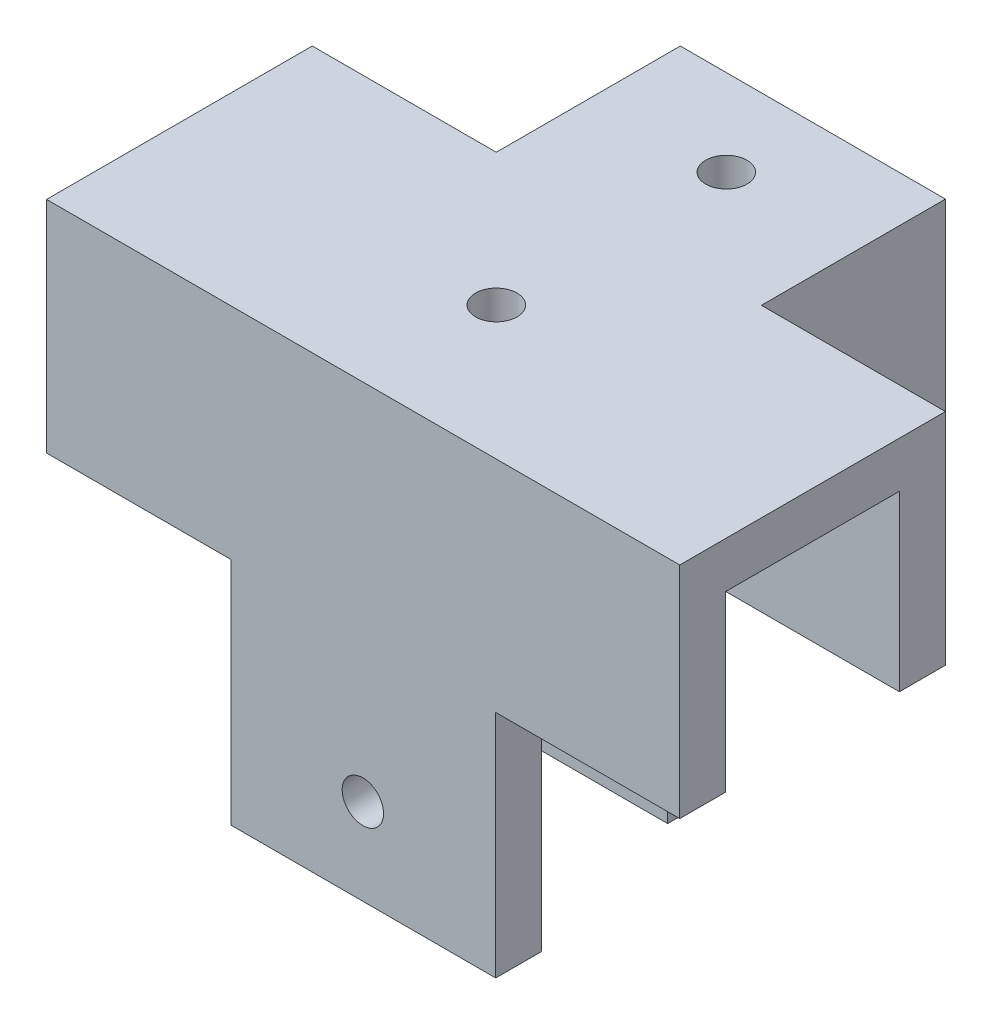
ISO-10303-21;
HEADER;
FILE_DESCRIPTION(('STEP AP214'),'2;1');
FILE_NAME('part.step','',(''),(''),'','','');
FILE_SCHEMA(('AUTOMOTIVE_DESIGN { 1 0 10303 214 1 1 1 1 }'));
ENDSEC;
DATA;
#1=APPLICATION_CONTEXT('core data for automotive mechanical design processes');
#2=APPLICATION_PROTOCOL_DEFINITION('international standard','automotive_design',2000,#1);
#3=PRODUCT_CONTEXT('',#1,'mechanical');
#4=PRODUCT('Part','Part','',(#3));
#5=PRODUCT_RELATED_PRODUCT_CATEGORY('part','',(#4));
#6=PRODUCT_DEFINITION_FORMATION('','',#4);
#7=PRODUCT_DEFINITION_CONTEXT('part definition',#1,'design');
#8=PRODUCT_DEFINITION('design','',#6,#7);
#9=PRODUCT_DEFINITION_SHAPE('','',#8);
#10=(LENGTH_UNIT() NAMED_UNIT(*) SI_UNIT(.MILLI.,.METRE.));
#11=(NAMED_UNIT(*) PLANE_ANGLE_UNIT() SI_UNIT($,.RADIAN.));
#12=(NAMED_UNIT(*) SI_UNIT($,.STERADIAN.) SOLID_ANGLE_UNIT());
#13=UNCERTAINTY_MEASURE_WITH_UNIT(LENGTH_MEASURE(1.E-05),#10,'distance_accuracy_value','');
#14=(GEOMETRIC_REPRESENTATION_CONTEXT(3) GLOBAL_UNCERTAINTY_ASSIGNED_CONTEXT((#13)) GLOBAL_UNIT_ASSIGNED_CONTEXT((#10,
#11,#12)) REPRESENTATION_CONTEXT('',''));
#15=CARTESIAN_POINT('',(0.,0.,0.));
#16=DIRECTION('',(0.,0.,1.));
#17=DIRECTION('',(1.,0.,0.));
#18=AXIS2_PLACEMENT_3D('',#15,#16,#17);
#19=CARTESIAN_POINT('',(0.,0.,0.));
#20=DIRECTION('',(0.,1.,0.));
#21=DIRECTION('',(0.,0.,1.));
#22=AXIS2_PLACEMENT_3D('',#19,#20,#21);
#23=PLANE('',#22);
#24=DIRECTION('',(0.,0.,-1.));
#25=VECTOR('',#24,1.);
#26=CARTESIAN_POINT('',(-5.98076923076923,0.,-9.38461538461537));
#27=LINE('',#26,#25);
#28=CARTESIAN_POINT('',(-5.98076923076923,0.,-5.38461538461537));
#29=VERTEX_POINT('',#28);
#30=CARTESIAN_POINT('',(-5.98076923076923,0.,-9.38461538461537));
#31=VERTEX_POINT('',#30);
#32=EDGE_CURVE('E497',#29,#31,#27,.T.);
#33=ORIENTED_EDGE('',*,*,#32,.F.);
#34=DIRECTION('',(1.,0.,0.));
#35=VECTOR('',#34,1.);
#36=CARTESIAN_POINT('',(0.,0.,-5.38461538461537));
#37=LINE('',#36,#35);
#38=CARTESIAN_POINT('',(-22.0307692307692,0.,-5.38461538461537));
#39=VERTEX_POINT('',#38);
#40=EDGE_CURVE('E397',#39,#29,#37,.T.);
#41=ORIENTED_EDGE('',*,*,#40,.F.);
#42=DIRECTION('',(0.,0.,1.));
#43=VECTOR('',#42,1.);
#44=CARTESIAN_POINT('',(-22.0307692307692,0.,0.));
#45=LINE('',#44,#43);
#46=CARTESIAN_POINT('',(-22.0307692307692,0.,-9.38461538461537));
#47=VERTEX_POINT('',#46);
#48=EDGE_CURVE('E394',#47,#39,#45,.T.);
#49=ORIENTED_EDGE('',*,*,#48,.F.);
#50=DIRECTION('',(1.,0.,0.));
#51=VECTOR('',#50,1.);
#52=CARTESIAN_POINT('',(0.,0.,-9.38461538461537));
#53=LINE('',#52,#51);
#54=CARTESIAN_POINT('',(-6.03076923076923,0.,-9.38461538461537));
#55=VERTEX_POINT('',#54);
#56=EDGE_CURVE('E390',#47,#55,#53,.T.);
#57=ORIENTED_EDGE('',*,*,#56,.T.);
#58=DIRECTION('',(0.,0.,-1.));
#59=VECTOR('',#58,1.);
#60=CARTESIAN_POINT('',(-6.03076923076923,0.,0.));
#61=LINE('',#60,#59);
#62=CARTESIAN_POINT('',(-6.03076923076923,0.,-25.3846153846154));
#63=VERTEX_POINT('',#62);
#64=EDGE_CURVE('E377',#55,#63,#61,.T.);
#65=ORIENTED_EDGE('',*,*,#64,.T.);
#66=DIRECTION('',(-1.,0.,0.));
#67=VECTOR('',#66,1.);
#68=CARTESIAN_POINT('',(0.,0.,-25.3846153846154));
#69=LINE('',#68,#67);
#70=CARTESIAN_POINT('',(-2.03076923076923,0.,-25.3846153846154));
#71=VERTEX_POINT('',#70);
#72=EDGE_CURVE('E382',#71,#63,#69,.T.);
#73=ORIENTED_EDGE('',*,*,#72,.F.);
#74=DIRECTION('',(0.,0.,1.));
#75=VECTOR('',#74,1.);
#76=CARTESIAN_POINT('',(-2.03076923076923,0.,0.));
#77=LINE('',#76,#75);
#78=CARTESIAN_POINT('',(-2.03076923076923,0.,-9.38461538461537));
#79=VERTEX_POINT('',#78);
#80=EDGE_CURVE('E400',#71,#79,#77,.T.);
#81=ORIENTED_EDGE('',*,*,#80,.T.);
#82=DIRECTION('',(1.,0.,0.));
#83=VECTOR('',#82,1.);
#84=CARTESIAN_POINT('',(12.8692307692308,0.,-9.38461538461537));
#85=LINE('',#84,#83);
#86=EDGE_CURVE('E58',#31,#79,#85,.T.);
#87=ORIENTED_EDGE('',*,*,#86,.F.);
#88=EDGE_LOOP('',(#33,#41,#49,#57,#65,#73,#81,#87));
#89=FACE_BOUND('',#88,.T.);
#90=ADVANCED_FACE('F41',(#89),#23,.F.);
#91=CARTESIAN_POINT('',(0.,0.,0.));
#92=DIRECTION('',(0.,1.,0.));
#93=DIRECTION('',(0.,0.,1.));
#94=AXIS2_PLACEMENT_3D('',#91,#92,#93);
#95=PLANE('',#94);
#96=DIRECTION('',(0.,0.,1.));
#97=VECTOR('',#96,1.);
#98=CARTESIAN_POINT('',(17.0192307692308,0.,9.71538461538463));
#99=LINE('',#98,#97);
#100=CARTESIAN_POINT('',(17.0192307692308,0.,9.71538461538463));
#101=VERTEX_POINT('',#100);
#102=CARTESIAN_POINT('',(17.0192307692308,0.,13.7153846153846));
#103=VERTEX_POINT('',#102);
#104=EDGE_CURVE('E491',#101,#103,#99,.T.);
#105=ORIENTED_EDGE('',*,*,#104,.F.);
#106=DIRECTION('',(1.,0.,0.));
#107=VECTOR('',#106,1.);
#108=CARTESIAN_POINT('',(0.,0.,9.71538461538463));
#109=LINE('',#108,#107);
#110=CARTESIAN_POINT('',(33.0192307692308,0.,9.71538461538463));
#111=VERTEX_POINT('',#110);
#112=EDGE_CURVE('E261',#101,#111,#109,.T.);
#113=ORIENTED_EDGE('',*,*,#112,.T.);
#114=DIRECTION('',(0.,0.,1.));
#115=VECTOR('',#114,1.);
#116=CARTESIAN_POINT('',(33.0192307692308,0.,0.));
#117=LINE('',#116,#115);
#118=CARTESIAN_POINT('',(33.0192307692308,0.,13.7153846153846));
#119=VERTEX_POINT('',#118);
#120=EDGE_CURVE('E251',#111,#119,#117,.T.);
#121=ORIENTED_EDGE('',*,*,#120,.T.);
#122=DIRECTION('',(1.,0.,0.));
#123=VECTOR('',#122,1.);
#124=CARTESIAN_POINT('',(0.,0.,13.7153846153846));
#125=LINE('',#124,#123);
#126=EDGE_CURVE('E270',#103,#119,#125,.T.);
#127=ORIENTED_EDGE('',*,*,#126,.F.);
#128=EDGE_LOOP('',(#105,#113,#121,#127));
#129=FACE_BOUND('',#128,.T.);
#130=ADVANCED_FACE('F569',(#129),#95,.F.);
#131=CARTESIAN_POINT('',(-5.98076923076923,0.,13.7153846153846));
#132=VERTEX_POINT('',#131);
#133=CARTESIAN_POINT('',(-5.98076923076923,0.,9.71538461538463));
#134=VERTEX_POINT('',#133);
#135=EDGE_CURVE('E447',#132,#134,#27,.T.);
#136=ORIENTED_EDGE('',*,*,#135,.F.);
#137=CARTESIAN_POINT('',(-22.0307692307692,0.,13.7153846153846));
#138=VERTEX_POINT('',#137);
#139=EDGE_CURVE('E257',#138,#132,#125,.T.);
#140=ORIENTED_EDGE('',*,*,#139,.F.);
#141=DIRECTION('',(0.,0.,1.));
#142=VECTOR('',#141,1.);
#143=CARTESIAN_POINT('',(-22.0307692307692,0.,0.));
#144=LINE('',#143,#142);
#145=CARTESIAN_POINT('',(-22.0307692307692,0.,9.71538461538463));
#146=VERTEX_POINT('',#145);
#147=EDGE_CURVE('E265',#146,#138,#144,.T.);
#148=ORIENTED_EDGE('',*,*,#147,.F.);
#149=EDGE_CURVE('E262',#146,#134,#109,.T.);
#150=ORIENTED_EDGE('',*,*,#149,.T.);
#151=EDGE_LOOP('',(#136,#140,#148,#150));
#152=FACE_BOUND('',#151,.T.);
#153=ADVANCED_FACE('F574',(#152),#95,.F.);
#154=CARTESIAN_POINT('',(-6.03076923076923,15.1,0.));
#155=DIRECTION('',(-1.,0.,0.));
#156=DIRECTION('',(0.,0.,1.));
#157=AXIS2_PLACEMENT_3D('',#154,#155,#156);
#158=PLANE('',#157);
#159=ORIENTED_EDGE('',*,*,#64,.F.);
#160=DIRECTION('',(0.,-1.,0.));
#161=VECTOR('',#160,1.);
#162=CARTESIAN_POINT('',(-6.03076923076923,15.1,-9.38461538461537));
#163=LINE('',#162,#161);
#164=CARTESIAN_POINT('',(-6.03076923076923,19.1,-9.38461538461537));
#165=VERTEX_POINT('',#164);
#166=EDGE_CURVE('E11',#165,#55,#163,.T.);
#167=ORIENTED_EDGE('',*,*,#166,.F.);
#168=DIRECTION('',(0.,0.,1.));
#169=VECTOR('',#168,1.);
#170=CARTESIAN_POINT('',(-6.03076923076923,19.1,0.));
#171=LINE('',#170,#169);
#172=CARTESIAN_POINT('',(-6.03076923076923,19.1,-25.3846153846154));
#173=VERTEX_POINT('',#172);
#174=EDGE_CURVE('E322',#173,#165,#171,.T.);
#175=ORIENTED_EDGE('',*,*,#174,.F.);
#176=DIRECTION('',(0.,-1.,0.));
#177=VECTOR('',#176,1.);
#178=CARTESIAN_POINT('',(-6.03076923076923,15.1,-25.3846153846154));
#179=LINE('',#178,#177);
#180=EDGE_CURVE('E386',#173,#63,#179,.T.);
#181=ORIENTED_EDGE('',*,*,#180,.T.);
#182=EDGE_LOOP('',(#159,#167,#175,#181));
#183=FACE_BOUND('',#182,.T.);
#184=ADVANCED_FACE('F43',(#183),#158,.T.);
#185=CARTESIAN_POINT('',(0.,15.1,-9.38461538461537));
#186=DIRECTION('',(0.,0.,-1.));
#187=DIRECTION('',(-1.,0.,0.));
#188=AXIS2_PLACEMENT_3D('',#185,#186,#187);
#189=PLANE('',#188);
#190=ORIENTED_EDGE('',*,*,#56,.F.);
#191=DIRECTION('',(0.,-1.,0.));
#192=VECTOR('',#191,1.);
#193=CARTESIAN_POINT('',(-22.0307692307692,15.1,-9.38461538461537));
#194=LINE('',#193,#192);
#195=CARTESIAN_POINT('',(-22.0307692307692,19.1,-9.38461538461537));
#196=VERTEX_POINT('',#195);
#197=EDGE_CURVE('E51',#196,#47,#194,.T.);
#198=ORIENTED_EDGE('',*,*,#197,.F.);
#199=DIRECTION('',(1.,0.,0.));
#200=VECTOR('',#199,1.);
#201=CARTESIAN_POINT('',(0.,19.1,-9.38461538461537));
#202=LINE('',#201,#200);
#203=EDGE_CURVE('E326',#196,#165,#202,.T.);
#204=ORIENTED_EDGE('',*,*,#203,.T.);
#205=ORIENTED_EDGE('',*,*,#166,.T.);
#206=EDGE_LOOP('',(#190,#198,#204,#205));
#207=FACE_BOUND('',#206,.T.);
#208=ADVANCED_FACE('F429',(#207),#189,.T.);
#209=CARTESIAN_POINT('',(-22.0307692307692,15.1,0.));
#210=DIRECTION('',(1.,0.,0.));
#211=DIRECTION('',(0.,0.,-1.));
#212=AXIS2_PLACEMENT_3D('',#209,#210,#211);
#213=PLANE('',#212);
#214=ORIENTED_EDGE('',*,*,#48,.T.);
#215=DIRECTION('',(0.,-1.,0.));
#216=VECTOR('',#215,1.);
#217=CARTESIAN_POINT('',(-22.0307692307692,15.1,-5.38461538461537));
#218=LINE('',#217,#216);
#219=CARTESIAN_POINT('',(-22.0307692307692,15.1,-5.38461538461537));
#220=VERTEX_POINT('',#219);
#221=EDGE_CURVE('E414',#220,#39,#218,.T.);
#222=ORIENTED_EDGE('',*,*,#221,.F.);
#223=DIRECTION('',(0.,0.,1.));
#224=VECTOR('',#223,1.);
#225=CARTESIAN_POINT('',(-22.0307692307692,15.1,0.));
#226=LINE('',#225,#224);
#227=CARTESIAN_POINT('',(-22.0307692307692,15.1,9.71538461538463));
#228=VERTEX_POINT('',#227);
#229=EDGE_CURVE('E321',#220,#228,#226,.T.);
#230=ORIENTED_EDGE('',*,*,#229,.T.);
#231=DIRECTION('',(0.,-1.,0.));
#232=VECTOR('',#231,1.);
#233=CARTESIAN_POINT('',(-22.0307692307692,15.1,9.71538461538463));
#234=LINE('',#233,#232);
#235=EDGE_CURVE('E256',#228,#146,#234,.T.);
#236=ORIENTED_EDGE('',*,*,#235,.T.);
#237=ORIENTED_EDGE('',*,*,#147,.T.);
#238=DIRECTION('',(0.,-1.,0.));
#239=VECTOR('',#238,1.);
#240=CARTESIAN_POINT('',(-22.0307692307692,19.1,13.7153846153846));
#241=LINE('',#240,#239);
#242=CARTESIAN_POINT('',(-22.0307692307692,19.1,13.7153846153846));
#243=VERTEX_POINT('',#242);
#244=EDGE_CURVE('E374',#243,#138,#241,.T.);
#245=ORIENTED_EDGE('',*,*,#244,.F.);
#246=DIRECTION('',(0.,0.,1.));
#247=VECTOR('',#246,1.);
#248=CARTESIAN_POINT('',(-22.0307692307692,19.1,0.));
#249=LINE('',#248,#247);
#250=EDGE_CURVE('E331',#196,#243,#249,.T.);
#251=ORIENTED_EDGE('',*,*,#250,.F.);
#252=ORIENTED_EDGE('',*,*,#197,.T.);
#253=EDGE_LOOP('',(#214,#222,#230,#236,#237,#245,#251,#252));
#254=FACE_BOUND('',#253,.T.);
#255=ADVANCED_FACE('F422',(#254),#213,.F.);
#256=CARTESIAN_POINT('',(0.,15.1,-5.38461538461537));
#257=DIRECTION('',(0.,0.,-1.));
#258=DIRECTION('',(-1.,0.,0.));
#259=AXIS2_PLACEMENT_3D('',#256,#257,#258);
#260=PLANE('',#259);
#261=CARTESIAN_POINT('',(5.46923076923077,-12.5,-5.38461538461537));
#262=DIRECTION('',(0.,0.,-1.));
#263=DIRECTION('',(-1.,0.,0.));
#264=AXIS2_PLACEMENT_3D('',#261,#262,#263);
#265=CIRCLE('',#264,1.8);
#266=CARTESIAN_POINT('',(3.66923076923077,-12.5,-5.38461538461537));
#267=VERTEX_POINT('',#266);
#268=EDGE_CURVE('E530',#267,#267,#265,.T.);
#269=ORIENTED_EDGE('',*,*,#268,.T.);
#270=EDGE_LOOP('',(#269));
#271=FACE_BOUND('',#270,.T.);
#272=ORIENTED_EDGE('',*,*,#40,.T.);
#273=DIRECTION('',(-1.,0.,0.));
#274=VECTOR('',#273,1.);
#275=CARTESIAN_POINT('',(0.,0.,-5.38461538461537));
#276=LINE('',#275,#274);
#277=CARTESIAN_POINT('',(-2.13076923076923,0.,-5.38461538461537));
#278=VERTEX_POINT('',#277);
#279=EDGE_CURVE('E66',#278,#29,#276,.T.);
#280=ORIENTED_EDGE('',*,*,#279,.F.);
#281=DIRECTION('',(0.,1.,0.));
#282=VECTOR('',#281,1.);
#283=CARTESIAN_POINT('',(-2.13076923076923,-20.,-5.38461538461537));
#284=LINE('',#283,#282);
#285=CARTESIAN_POINT('',(-2.13076923076923,-20.,-5.38461538461537));
#286=VERTEX_POINT('',#285);
#287=EDGE_CURVE('E219',#286,#278,#284,.T.);
#288=ORIENTED_EDGE('',*,*,#287,.F.);
#289=DIRECTION('',(-1.,0.,0.));
#290=VECTOR('',#289,1.);
#291=CARTESIAN_POINT('',(12.8692307692308,-20.,-5.38461538461537));
#292=LINE('',#291,#290);
#293=CARTESIAN_POINT('',(12.8692307692308,-20.,-5.38461538461537));
#294=VERTEX_POINT('',#293);
#295=EDGE_CURVE('E212',#294,#286,#292,.T.);
#296=ORIENTED_EDGE('',*,*,#295,.F.);
#297=DIRECTION('',(0.,1.,0.));
#298=VECTOR('',#297,1.);
#299=CARTESIAN_POINT('',(12.8692307692308,-20.,-5.38461538461537));
#300=LINE('',#299,#298);
#301=CARTESIAN_POINT('',(12.8692307692308,0.,-5.38461538461537));
#302=VERTEX_POINT('',#301);
#303=EDGE_CURVE('E217',#294,#302,#300,.T.);
#304=ORIENTED_EDGE('',*,*,#303,.T.);
#305=DIRECTION('',(-1.,0.,0.));
#306=VECTOR('',#305,1.);
#307=CARTESIAN_POINT('',(12.8692307692308,0.,-5.38461538461537));
#308=LINE('',#307,#306);
#309=CARTESIAN_POINT('',(-2.03076923076923,0.,-5.38461538461537));
#310=VERTEX_POINT('',#309);
#311=EDGE_CURVE('E492',#302,#310,#308,.T.);
#312=ORIENTED_EDGE('',*,*,#311,.T.);
#313=DIRECTION('',(0.,-1.,0.));
#314=VECTOR('',#313,1.);
#315=CARTESIAN_POINT('',(-2.03076923076923,15.1,-5.38461538461537));
#316=LINE('',#315,#314);
#317=CARTESIAN_POINT('',(-2.03076923076923,15.1,-5.38461538461537));
#318=VERTEX_POINT('',#317);
#319=EDGE_CURVE('E411',#318,#310,#316,.T.);
#320=ORIENTED_EDGE('',*,*,#319,.F.);
#321=DIRECTION('',(1.,0.,0.));
#322=VECTOR('',#321,1.);
#323=CARTESIAN_POINT('',(0.,15.1,-5.38461538461537));
#324=LINE('',#323,#322);
#325=EDGE_CURVE('E378',#220,#318,#324,.T.);
#326=ORIENTED_EDGE('',*,*,#325,.F.);
#327=ORIENTED_EDGE('',*,*,#221,.T.);
#328=EDGE_LOOP('',(#272,#280,#288,#296,#304,#312,#320,#326,#327));
#329=FACE_BOUND('',#328,.T.);
#330=ADVANCED_FACE('F214',(#271,#329),#260,.F.);
#331=CARTESIAN_POINT('',(-2.03076923076923,15.1,0.));
#332=DIRECTION('',(1.,0.,0.));
#333=DIRECTION('',(0.,0.,-1.));
#334=AXIS2_PLACEMENT_3D('',#331,#332,#333);
#335=PLANE('',#334);
#336=ORIENTED_EDGE('',*,*,#80,.F.);
#337=DIRECTION('',(0.,-1.,0.));
#338=VECTOR('',#337,1.);
#339=CARTESIAN_POINT('',(-2.03076923076923,15.1,-25.3846153846154));
#340=LINE('',#339,#338);
#341=CARTESIAN_POINT('',(-2.03076923076923,15.1,-25.3846153846154));
#342=VERTEX_POINT('',#341);
#343=EDGE_CURVE('E408',#342,#71,#340,.T.);
#344=ORIENTED_EDGE('',*,*,#343,.F.);
#345=DIRECTION('',(0.,0.,1.));
#346=VECTOR('',#345,1.);
#347=CARTESIAN_POINT('',(-2.03076923076923,15.1,0.));
#348=LINE('',#347,#346);
#349=EDGE_CURVE('E381',#342,#318,#348,.T.);
#350=ORIENTED_EDGE('',*,*,#349,.T.);
#351=ORIENTED_EDGE('',*,*,#319,.T.);
#352=DIRECTION('',(0.,0.,-1.));
#353=VECTOR('',#352,1.);
#354=CARTESIAN_POINT('',(-2.03076923076923,0.,0.));
#355=LINE('',#354,#353);
#356=EDGE_CURVE('E239',#310,#79,#355,.T.);
#357=ORIENTED_EDGE('',*,*,#356,.T.);
#358=EDGE_LOOP('',(#336,#344,#350,#351,#357));
#359=FACE_BOUND('',#358,.T.);
#360=ADVANCED_FACE('F438',(#359),#335,.T.);
#361=CARTESIAN_POINT('',(0.,15.1,-25.3846153846154));
#362=DIRECTION('',(0.,0.,1.));
#363=DIRECTION('',(1.,0.,0.));
#364=AXIS2_PLACEMENT_3D('',#361,#362,#363);
#365=PLANE('',#364);
#366=ORIENTED_EDGE('',*,*,#72,.T.);
#367=ORIENTED_EDGE('',*,*,#180,.F.);
#368=DIRECTION('',(-1.,0.,0.));
#369=VECTOR('',#368,1.);
#370=CARTESIAN_POINT('',(0.,19.1,-25.3846153846154));
#371=LINE('',#370,#369);
#372=CARTESIAN_POINT('',(17.0192307692308,19.1,-25.3846153846154));
#373=VERTEX_POINT('',#372);
#374=EDGE_CURVE('E349',#373,#173,#371,.T.);
#375=ORIENTED_EDGE('',*,*,#374,.F.);
#376=DIRECTION('',(0.,-1.,0.));
#377=VECTOR('',#376,1.);
#378=CARTESIAN_POINT('',(17.0192307692308,19.1,-25.3846153846154));
#379=LINE('',#378,#377);
#380=CARTESIAN_POINT('',(17.0192307692308,0.,-25.3846153846154));
#381=VERTEX_POINT('',#380);
#382=EDGE_CURVE('E353',#373,#381,#379,.T.);
#383=ORIENTED_EDGE('',*,*,#382,.T.);
#384=DIRECTION('',(1.,0.,0.));
#385=VECTOR('',#384,1.);
#386=CARTESIAN_POINT('',(0.,0.,-25.3846153846154));
#387=LINE('',#386,#385);
#388=CARTESIAN_POINT('',(13.0192307692308,0.,-25.3846153846154));
#389=VERTEX_POINT('',#388);
#390=EDGE_CURVE('E298',#389,#381,#387,.T.);
#391=ORIENTED_EDGE('',*,*,#390,.F.);
#392=DIRECTION('',(0.,-1.,0.));
#393=VECTOR('',#392,1.);
#394=CARTESIAN_POINT('',(13.0192307692308,15.1,-25.3846153846154));
#395=LINE('',#394,#393);
#396=CARTESIAN_POINT('',(13.0192307692308,15.1,-25.3846153846154));
#397=VERTEX_POINT('',#396);
#398=EDGE_CURVE('E318',#397,#389,#395,.T.);
#399=ORIENTED_EDGE('',*,*,#398,.F.);
#400=DIRECTION('',(-1.,0.,0.));
#401=VECTOR('',#400,1.);
#402=CARTESIAN_POINT('',(0.,15.1,-25.3846153846154));
#403=LINE('',#402,#401);
#404=EDGE_CURVE('E327',#397,#342,#403,.T.);
#405=ORIENTED_EDGE('',*,*,#404,.T.);
#406=ORIENTED_EDGE('',*,*,#343,.T.);
#407=EDGE_LOOP('',(#366,#367,#375,#383,#391,#399,#405,#406));
#408=FACE_BOUND('',#407,.T.);
#409=ADVANCED_FACE('F565',(#408),#365,.F.);
#410=CARTESIAN_POINT('',(0.,15.1,0.));
#411=DIRECTION('',(0.,1.,0.));
#412=DIRECTION('',(0.,0.,1.));
#413=AXIS2_PLACEMENT_3D('',#410,#411,#412);
#414=PLANE('',#413);
#415=CARTESIAN_POINT('',(5.46923076923077,15.1,-17.8846153846154));
#416=DIRECTION('',(0.,1.,0.));
#417=DIRECTION('',(0.,0.,1.));
#418=AXIS2_PLACEMENT_3D('',#415,#416,#417);
#419=CIRCLE('',#418,1.8);
#420=CARTESIAN_POINT('',(5.46923076923077,15.1,-16.0846153846154));
#421=VERTEX_POINT('',#420);
#422=EDGE_CURVE('E502',#421,#421,#419,.T.);
#423=ORIENTED_EDGE('',*,*,#422,.T.);
#424=EDGE_LOOP('',(#423));
#425=FACE_BOUND('',#424,.T.);
#426=CARTESIAN_POINT('',(5.46923076923077,15.1,2.11538461538463));
#427=DIRECTION('',(0.,1.,0.));
#428=DIRECTION('',(0.,0.,1.));
#429=AXIS2_PLACEMENT_3D('',#426,#427,#428);
#430=CIRCLE('',#429,1.8);
#431=CARTESIAN_POINT('',(5.46923076923077,15.1,3.91538461538463));
#432=VERTEX_POINT('',#431);
#433=EDGE_CURVE('E521',#432,#432,#430,.T.);
#434=ORIENTED_EDGE('',*,*,#433,.T.);
#435=EDGE_LOOP('',(#434));
#436=FACE_BOUND('',#435,.T.);
#437=DIRECTION('',(0.,0.,1.));
#438=VECTOR('',#437,1.);
#439=CARTESIAN_POINT('',(33.0192307692308,15.1,0.));
#440=LINE('',#439,#438);
#441=CARTESIAN_POINT('',(33.0192307692308,15.1,-5.38461538461537));
#442=VERTEX_POINT('',#441);
#443=CARTESIAN_POINT('',(33.0192307692308,15.1,9.71538461538463));
#444=VERTEX_POINT('',#443);
#445=EDGE_CURVE('E357',#442,#444,#440,.T.);
#446=ORIENTED_EDGE('',*,*,#445,.T.);
#447=DIRECTION('',(1.,0.,0.));
#448=VECTOR('',#447,1.);
#449=CARTESIAN_POINT('',(0.,15.1,9.71538461538463));
#450=LINE('',#449,#448);
#451=EDGE_CURVE('E252',#228,#444,#450,.T.);
#452=ORIENTED_EDGE('',*,*,#451,.F.);
#453=ORIENTED_EDGE('',*,*,#229,.F.);
#454=ORIENTED_EDGE('',*,*,#325,.T.);
#455=ORIENTED_EDGE('',*,*,#349,.F.);
#456=ORIENTED_EDGE('',*,*,#404,.F.);
#457=DIRECTION('',(0.,0.,-1.));
#458=VECTOR('',#457,1.);
#459=CARTESIAN_POINT('',(13.0192307692308,15.1,0.));
#460=LINE('',#459,#458);
#461=CARTESIAN_POINT('',(13.0192307692308,15.1,-5.38461538461537));
#462=VERTEX_POINT('',#461);
#463=EDGE_CURVE('E281',#462,#397,#460,.T.);
#464=ORIENTED_EDGE('',*,*,#463,.F.);
#465=DIRECTION('',(-1.,0.,0.));
#466=VECTOR('',#465,1.);
#467=CARTESIAN_POINT('',(0.,15.1,-5.38461538461537));
#468=LINE('',#467,#466);
#469=EDGE_CURVE('E285',#442,#462,#468,.T.);
#470=ORIENTED_EDGE('',*,*,#469,.F.);
#471=EDGE_LOOP('',(#446,#452,#453,#454,#455,#456,#464,#470));
#472=FACE_BOUND('',#471,.T.);
#473=ADVANCED_FACE('F582',(#425,#436,#472),#414,.F.);
#474=CARTESIAN_POINT('',(0.,19.1,13.7153846153846));
#475=DIRECTION('',(0.,0.,-1.));
#476=DIRECTION('',(-1.,0.,0.));
#477=AXIS2_PLACEMENT_3D('',#474,#475,#476);
#478=PLANE('',#477);
#479=CARTESIAN_POINT('',(5.46923076923077,-12.5,13.7153846153846));
#480=DIRECTION('',(0.,0.,1.));
#481=DIRECTION('',(1.,0.,0.));
#482=AXIS2_PLACEMENT_3D('',#479,#480,#481);
#483=CIRCLE('',#482,1.8);
#484=CARTESIAN_POINT('',(7.26923076923077,-12.5,13.7153846153846));
#485=VERTEX_POINT('',#484);
#486=EDGE_CURVE('E541',#485,#485,#483,.T.);
#487=ORIENTED_EDGE('',*,*,#486,.F.);
#488=EDGE_LOOP('',(#487));
#489=FACE_BOUND('',#488,.T.);
#490=ORIENTED_EDGE('',*,*,#244,.T.);
#491=ORIENTED_EDGE('',*,*,#139,.T.);
#492=DIRECTION('',(0.,1.,0.));
#493=VECTOR('',#492,1.);
#494=CARTESIAN_POINT('',(-5.98076923076923,-20.,13.7153846153846));
#495=LINE('',#494,#493);
#496=CARTESIAN_POINT('',(-5.98076923076923,-20.,13.7153846153846));
#497=VERTEX_POINT('',#496);
#498=EDGE_CURVE('E462',#497,#132,#495,.T.);
#499=ORIENTED_EDGE('',*,*,#498,.F.);
#500=DIRECTION('',(-1.,0.,0.));
#501=VECTOR('',#500,1.);
#502=CARTESIAN_POINT('',(17.0192307692308,-20.,13.7153846153846));
#503=LINE('',#502,#501);
#504=CARTESIAN_POINT('',(17.0192307692308,-20.,13.7153846153846));
#505=VERTEX_POINT('',#504);
#506=EDGE_CURVE('E508',#505,#497,#503,.T.);
#507=ORIENTED_EDGE('',*,*,#506,.F.);
#508=DIRECTION('',(0.,1.,0.));
#509=VECTOR('',#508,1.);
#510=CARTESIAN_POINT('',(17.0192307692308,-20.,13.7153846153846));
#511=LINE('',#510,#509);
#512=EDGE_CURVE('E466',#505,#103,#511,.T.);
#513=ORIENTED_EDGE('',*,*,#512,.T.);
#514=ORIENTED_EDGE('',*,*,#126,.T.);
#515=DIRECTION('',(0.,-1.,0.));
#516=VECTOR('',#515,1.);
#517=CARTESIAN_POINT('',(33.0192307692308,19.1,13.7153846153846));
#518=LINE('',#517,#516);
#519=CARTESIAN_POINT('',(33.0192307692308,19.1,13.7153846153846));
#520=VERTEX_POINT('',#519);
#521=EDGE_CURVE('E370',#520,#119,#518,.T.);
#522=ORIENTED_EDGE('',*,*,#521,.F.);
#523=DIRECTION('',(1.,0.,0.));
#524=VECTOR('',#523,1.);
#525=CARTESIAN_POINT('',(0.,19.1,13.7153846153846));
#526=LINE('',#525,#524);
#527=EDGE_CURVE('E334',#243,#520,#526,.T.);
#528=ORIENTED_EDGE('',*,*,#527,.F.);
#529=EDGE_LOOP('',(#490,#491,#499,#507,#513,#514,#522,#528));
#530=FACE_BOUND('',#529,.T.);
#531=ADVANCED_FACE('F579',(#489,#530),#478,.F.);
#532=CARTESIAN_POINT('',(33.0192307692308,19.1,0.));
#533=DIRECTION('',(1.,0.,0.));
#534=DIRECTION('',(0.,0.,-1.));
#535=AXIS2_PLACEMENT_3D('',#532,#533,#534);
#536=PLANE('',#535);
#537=ORIENTED_EDGE('',*,*,#445,.F.);
#538=DIRECTION('',(0.,-1.,0.));
#539=VECTOR('',#538,1.);
#540=CARTESIAN_POINT('',(33.0192307692308,15.1,-5.38461538461538));
#541=LINE('',#540,#539);
#542=CARTESIAN_POINT('',(33.0192307692308,0.,-5.38461538461538));
#543=VERTEX_POINT('',#542);
#544=EDGE_CURVE('E290',#442,#543,#541,.T.);
#545=ORIENTED_EDGE('',*,*,#544,.T.);
#546=DIRECTION('',(0.,0.,-1.));
#547=VECTOR('',#546,1.);
#548=CARTESIAN_POINT('',(33.0192307692308,0.,0.));
#549=LINE('',#548,#547);
#550=CARTESIAN_POINT('',(33.0192307692308,0.,-9.38461538461537));
#551=VERTEX_POINT('',#550);
#552=EDGE_CURVE('E286',#543,#551,#549,.T.);
#553=ORIENTED_EDGE('',*,*,#552,.T.);
#554=DIRECTION('',(0.,-1.,0.));
#555=VECTOR('',#554,1.);
#556=CARTESIAN_POINT('',(33.0192307692308,19.1,-9.38461538461537));
#557=LINE('',#556,#555);
#558=CARTESIAN_POINT('',(33.0192307692308,19.1,-9.38461538461537));
#559=VERTEX_POINT('',#558);
#560=EDGE_CURVE('E367',#559,#551,#557,.T.);
#561=ORIENTED_EDGE('',*,*,#560,.F.);
#562=DIRECTION('',(0.,0.,1.));
#563=VECTOR('',#562,1.);
#564=CARTESIAN_POINT('',(33.0192307692308,19.1,0.));
#565=LINE('',#564,#563);
#566=EDGE_CURVE('E337',#559,#520,#565,.T.);
#567=ORIENTED_EDGE('',*,*,#566,.T.);
#568=ORIENTED_EDGE('',*,*,#521,.T.);
#569=ORIENTED_EDGE('',*,*,#120,.F.);
#570=DIRECTION('',(0.,-1.,0.));
#571=VECTOR('',#570,1.);
#572=CARTESIAN_POINT('',(33.0192307692308,15.1,9.71538461538463));
#573=LINE('',#572,#571);
#574=EDGE_CURVE('E276',#444,#111,#573,.T.);
#575=ORIENTED_EDGE('',*,*,#574,.F.);
#576=EDGE_LOOP('',(#537,#545,#553,#561,#567,#568,#569,#575));
#577=FACE_BOUND('',#576,.T.);
#578=ADVANCED_FACE('F591',(#577),#536,.T.);
#579=CARTESIAN_POINT('',(0.,19.1,-9.38461538461537));
#580=DIRECTION('',(0.,0.,-1.));
#581=DIRECTION('',(-1.,0.,0.));
#582=AXIS2_PLACEMENT_3D('',#579,#580,#581);
#583=PLANE('',#582);
#584=ORIENTED_EDGE('',*,*,#560,.T.);
#585=DIRECTION('',(-1.,0.,0.));
#586=VECTOR('',#585,1.);
#587=CARTESIAN_POINT('',(0.,0.,-9.38461538461536));
#588=LINE('',#587,#586);
#589=CARTESIAN_POINT('',(17.0192307692308,0.,-9.38461538461537));
#590=VERTEX_POINT('',#589);
#591=EDGE_CURVE('E280',#551,#590,#588,.T.);
#592=ORIENTED_EDGE('',*,*,#591,.T.);
#593=DIRECTION('',(0.,-1.,0.));
#594=VECTOR('',#593,1.);
#595=CARTESIAN_POINT('',(17.0192307692308,19.1,-9.38461538461537));
#596=LINE('',#595,#594);
#597=CARTESIAN_POINT('',(17.0192307692308,19.1,-9.38461538461537));
#598=VERTEX_POINT('',#597);
#599=EDGE_CURVE('E364',#598,#590,#596,.T.);
#600=ORIENTED_EDGE('',*,*,#599,.F.);
#601=DIRECTION('',(1.,0.,0.));
#602=VECTOR('',#601,1.);
#603=CARTESIAN_POINT('',(0.,19.1,-9.38461538461537));
#604=LINE('',#603,#602);
#605=EDGE_CURVE('E341',#598,#559,#604,.T.);
#606=ORIENTED_EDGE('',*,*,#605,.T.);
#607=EDGE_LOOP('',(#584,#592,#600,#606));
#608=FACE_BOUND('',#607,.T.);
#609=ADVANCED_FACE('F601',(#608),#583,.T.);
#610=CARTESIAN_POINT('',(17.0192307692308,19.1,0.));
#611=DIRECTION('',(1.,0.,0.));
#612=DIRECTION('',(0.,0.,-1.));
#613=AXIS2_PLACEMENT_3D('',#610,#611,#612);
#614=PLANE('',#613);
#615=ORIENTED_EDGE('',*,*,#599,.T.);
#616=DIRECTION('',(0.,0.,-1.));
#617=VECTOR('',#616,1.);
#618=CARTESIAN_POINT('',(17.0192307692308,0.,0.));
#619=LINE('',#618,#617);
#620=EDGE_CURVE('E294',#590,#381,#619,.T.);
#621=ORIENTED_EDGE('',*,*,#620,.T.);
#622=ORIENTED_EDGE('',*,*,#382,.F.);
#623=DIRECTION('',(0.,0.,1.));
#624=VECTOR('',#623,1.);
#625=CARTESIAN_POINT('',(17.0192307692308,19.1,0.));
#626=LINE('',#625,#624);
#627=EDGE_CURVE('E345',#373,#598,#626,.T.);
#628=ORIENTED_EDGE('',*,*,#627,.T.);
#629=EDGE_LOOP('',(#615,#621,#622,#628));
#630=FACE_BOUND('',#629,.T.);
#631=ADVANCED_FACE('F598',(#630),#614,.T.);
#632=CARTESIAN_POINT('',(0.,19.1,0.));
#633=DIRECTION('',(0.,1.,0.));
#634=DIRECTION('',(0.,0.,1.));
#635=AXIS2_PLACEMENT_3D('',#632,#633,#634);
#636=PLANE('',#635);
#637=CARTESIAN_POINT('',(5.46923076923077,19.1,-17.8846153846154));
#638=DIRECTION('',(0.,1.,0.));
#639=DIRECTION('',(0.,0.,1.));
#640=AXIS2_PLACEMENT_3D('',#637,#638,#639);
#641=CIRCLE('',#640,1.8);
#642=CARTESIAN_POINT('',(5.46923076923077,19.1,-16.0846153846154));
#643=VERTEX_POINT('',#642);
#644=EDGE_CURVE('E525',#643,#643,#641,.T.);
#645=ORIENTED_EDGE('',*,*,#644,.F.);
#646=EDGE_LOOP('',(#645));
#647=FACE_BOUND('',#646,.T.);
#648=CARTESIAN_POINT('',(5.46923076923077,19.1,2.11538461538463));
#649=DIRECTION('',(0.,1.,0.));
#650=DIRECTION('',(0.,0.,1.));
#651=AXIS2_PLACEMENT_3D('',#648,#649,#650);
#652=CIRCLE('',#651,1.8);
#653=CARTESIAN_POINT('',(5.46923076923077,19.1,3.91538461538463));
#654=VERTEX_POINT('',#653);
#655=EDGE_CURVE('E526',#654,#654,#652,.T.);
#656=ORIENTED_EDGE('',*,*,#655,.F.);
#657=EDGE_LOOP('',(#656));
#658=FACE_BOUND('',#657,.T.);
#659=ORIENTED_EDGE('',*,*,#174,.T.);
#660=ORIENTED_EDGE('',*,*,#203,.F.);
#661=ORIENTED_EDGE('',*,*,#250,.T.);
#662=ORIENTED_EDGE('',*,*,#527,.T.);
#663=ORIENTED_EDGE('',*,*,#566,.F.);
#664=ORIENTED_EDGE('',*,*,#605,.F.);
#665=ORIENTED_EDGE('',*,*,#627,.F.);
#666=ORIENTED_EDGE('',*,*,#374,.T.);
#667=EDGE_LOOP('',(#659,#660,#661,#662,#663,#664,#665,#666));
#668=FACE_BOUND('',#667,.T.);
#669=ADVANCED_FACE('F596',(#647,#658,#668),#636,.T.);
#670=CARTESIAN_POINT('',(13.0192307692308,15.1,0.));
#671=DIRECTION('',(-1.,0.,0.));
#672=DIRECTION('',(0.,0.,1.));
#673=AXIS2_PLACEMENT_3D('',#670,#671,#672);
#674=PLANE('',#673);
#675=DIRECTION('',(0.,0.,-1.));
#676=VECTOR('',#675,1.);
#677=CARTESIAN_POINT('',(13.0192307692308,0.,0.));
#678=LINE('',#677,#676);
#679=CARTESIAN_POINT('',(13.0192307692308,0.,-5.38461538461537));
#680=VERTEX_POINT('',#679);
#681=EDGE_CURVE('E302',#680,#389,#678,.T.);
#682=ORIENTED_EDGE('',*,*,#681,.F.);
#683=DIRECTION('',(0.,-1.,0.));
#684=VECTOR('',#683,1.);
#685=CARTESIAN_POINT('',(13.0192307692308,15.1,-5.38461538461537));
#686=LINE('',#685,#684);
#687=EDGE_CURVE('E315',#462,#680,#686,.T.);
#688=ORIENTED_EDGE('',*,*,#687,.F.);
#689=ORIENTED_EDGE('',*,*,#463,.T.);
#690=ORIENTED_EDGE('',*,*,#398,.T.);
#691=EDGE_LOOP('',(#682,#688,#689,#690));
#692=FACE_BOUND('',#691,.T.);
#693=ADVANCED_FACE('F642',(#692),#674,.T.);
#694=CARTESIAN_POINT('',(0.,15.1,-5.38461538461537));
#695=DIRECTION('',(0.,0.,1.));
#696=DIRECTION('',(1.,0.,0.));
#697=AXIS2_PLACEMENT_3D('',#694,#695,#696);
#698=PLANE('',#697);
#699=DIRECTION('',(-1.,0.,0.));
#700=VECTOR('',#699,1.);
#701=CARTESIAN_POINT('',(0.,0.,-5.38461538461537));
#702=LINE('',#701,#700);
#703=EDGE_CURVE('E306',#543,#680,#702,.T.);
#704=ORIENTED_EDGE('',*,*,#703,.F.);
#705=ORIENTED_EDGE('',*,*,#544,.F.);
#706=ORIENTED_EDGE('',*,*,#469,.T.);
#707=ORIENTED_EDGE('',*,*,#687,.T.);
#708=EDGE_LOOP('',(#704,#705,#706,#707));
#709=FACE_BOUND('',#708,.T.);
#710=ADVANCED_FACE('F617',(#709),#698,.T.);
#711=CARTESIAN_POINT('',(0.,0.,0.));
#712=DIRECTION('',(0.,1.,0.));
#713=DIRECTION('',(0.,0.,1.));
#714=AXIS2_PLACEMENT_3D('',#711,#712,#713);
#715=PLANE('',#714);
#716=ORIENTED_EDGE('',*,*,#591,.F.);
#717=ORIENTED_EDGE('',*,*,#552,.F.);
#718=ORIENTED_EDGE('',*,*,#703,.T.);
#719=ORIENTED_EDGE('',*,*,#681,.T.);
#720=ORIENTED_EDGE('',*,*,#390,.T.);
#721=ORIENTED_EDGE('',*,*,#620,.F.);
#722=EDGE_LOOP('',(#716,#717,#718,#719,#720,#721));
#723=FACE_BOUND('',#722,.T.);
#724=ADVANCED_FACE('F622',(#723),#715,.F.);
#725=CARTESIAN_POINT('',(0.,15.1,9.71538461538463));
#726=DIRECTION('',(0.,0.,-1.));
#727=DIRECTION('',(-1.,0.,0.));
#728=AXIS2_PLACEMENT_3D('',#725,#726,#727);
#729=PLANE('',#728);
#730=CARTESIAN_POINT('',(5.46923076923077,-12.5,9.71538461538463));
#731=DIRECTION('',(0.,0.,-1.));
#732=DIRECTION('',(-1.,0.,0.));
#733=AXIS2_PLACEMENT_3D('',#730,#731,#732);
#734=CIRCLE('',#733,1.8);
#735=CARTESIAN_POINT('',(3.66923076923077,-12.5,9.71538461538463));
#736=VERTEX_POINT('',#735);
#737=EDGE_CURVE('E537',#736,#736,#734,.T.);
#738=ORIENTED_EDGE('',*,*,#737,.F.);
#739=EDGE_LOOP('',(#738));
#740=FACE_BOUND('',#739,.T.);
#741=ORIENTED_EDGE('',*,*,#149,.F.);
#742=ORIENTED_EDGE('',*,*,#235,.F.);
#743=ORIENTED_EDGE('',*,*,#451,.T.);
#744=ORIENTED_EDGE('',*,*,#574,.T.);
#745=ORIENTED_EDGE('',*,*,#112,.F.);
#746=DIRECTION('',(0.,1.,0.));
#747=VECTOR('',#746,1.);
#748=CARTESIAN_POINT('',(17.0192307692308,-20.,9.71538461538463));
#749=LINE('',#748,#747);
#750=CARTESIAN_POINT('',(17.0192307692308,-20.,9.71538461538463));
#751=VERTEX_POINT('',#750);
#752=EDGE_CURVE('E470',#751,#101,#749,.T.);
#753=ORIENTED_EDGE('',*,*,#752,.F.);
#754=DIRECTION('',(1.,0.,0.));
#755=VECTOR('',#754,1.);
#756=CARTESIAN_POINT('',(13.0192307692308,-20.,9.71538461538463));
#757=LINE('',#756,#755);
#758=CARTESIAN_POINT('',(-2.13076923076923,-20.,9.71538461538463));
#759=VERTEX_POINT('',#758);
#760=EDGE_CURVE('E483',#759,#751,#757,.T.);
#761=ORIENTED_EDGE('',*,*,#760,.F.);
#762=DIRECTION('',(0.,1.,0.));
#763=VECTOR('',#762,1.);
#764=CARTESIAN_POINT('',(-2.13076923076923,-20.,9.71538461538463));
#765=LINE('',#764,#763);
#766=CARTESIAN_POINT('',(-2.13076923076923,0.,9.71538461538463));
#767=VERTEX_POINT('',#766);
#768=EDGE_CURVE('E245',#759,#767,#765,.T.);
#769=ORIENTED_EDGE('',*,*,#768,.T.);
#770=EDGE_CURVE('E266',#134,#767,#109,.T.);
#771=ORIENTED_EDGE('',*,*,#770,.F.);
#772=EDGE_LOOP('',(#741,#742,#743,#744,#745,#753,#761,#769,#771));
#773=FACE_BOUND('',#772,.T.);
#774=ADVANCED_FACE('F480',(#740,#773),#729,.T.);
#775=CARTESIAN_POINT('',(0.,0.,0.));
#776=DIRECTION('',(0.,-1.,0.));
#777=DIRECTION('',(0.,0.,-1.));
#778=AXIS2_PLACEMENT_3D('',#775,#776,#777);
#779=PLANE('',#778);
#780=DIRECTION('',(0.,0.,1.));
#781=VECTOR('',#780,1.);
#782=CARTESIAN_POINT('',(-2.13076923076923,0.,-5.38461538461537));
#783=LINE('',#782,#781);
#784=EDGE_CURVE('E488',#278,#767,#783,.T.);
#785=ORIENTED_EDGE('',*,*,#784,.F.);
#786=ORIENTED_EDGE('',*,*,#279,.T.);
#787=EDGE_CURVE('E967',#134,#29,#27,.T.);
#788=ORIENTED_EDGE('',*,*,#787,.F.);
#789=ORIENTED_EDGE('',*,*,#770,.T.);
#790=EDGE_LOOP('',(#785,#786,#788,#789));
#791=FACE_BOUND('',#790,.T.);
#792=ADVANCED_FACE('F654',(#791),#779,.F.);
#793=CARTESIAN_POINT('',(12.8692307692308,-20.,-9.38461538461537));
#794=DIRECTION('',(-1.,0.,0.));
#795=DIRECTION('',(0.,0.,1.));
#796=AXIS2_PLACEMENT_3D('',#793,#794,#795);
#797=PLANE('',#796);
#798=DIRECTION('',(0.,0.,1.));
#799=VECTOR('',#798,1.);
#800=CARTESIAN_POINT('',(12.8692307692308,0.,-9.38461538461537));
#801=LINE('',#800,#799);
#802=CARTESIAN_POINT('',(12.8692307692308,0.,-9.38461538461537));
#803=VERTEX_POINT('',#802);
#804=EDGE_CURVE('E237',#803,#302,#801,.T.);
#805=ORIENTED_EDGE('',*,*,#804,.T.);
#806=ORIENTED_EDGE('',*,*,#303,.F.);
#807=DIRECTION('',(0.,0.,1.));
#808=VECTOR('',#807,1.);
#809=CARTESIAN_POINT('',(12.8692307692308,-20.,-9.38461538461537));
#810=LINE('',#809,#808);
#811=CARTESIAN_POINT('',(12.8692307692308,-20.,-9.38461538461537));
#812=VERTEX_POINT('',#811);
#813=EDGE_CURVE('E224',#812,#294,#810,.T.);
#814=ORIENTED_EDGE('',*,*,#813,.F.);
#815=DIRECTION('',(0.,1.,0.));
#816=VECTOR('',#815,1.);
#817=CARTESIAN_POINT('',(12.8692307692308,-20.,-9.38461538461537));
#818=LINE('',#817,#816);
#819=EDGE_CURVE('E457',#812,#803,#818,.T.);
#820=ORIENTED_EDGE('',*,*,#819,.T.);
#821=EDGE_LOOP('',(#805,#806,#814,#820));
#822=FACE_BOUND('',#821,.T.);
#823=ADVANCED_FACE('F235',(#822),#797,.F.);
#824=CARTESIAN_POINT('',(-2.13076923076923,-20.,-5.38461538461537));
#825=DIRECTION('',(-1.,0.,0.));
#826=DIRECTION('',(0.,0.,1.));
#827=AXIS2_PLACEMENT_3D('',#824,#825,#826);
#828=PLANE('',#827);
#829=ORIENTED_EDGE('',*,*,#784,.T.);
#830=ORIENTED_EDGE('',*,*,#768,.F.);
#831=DIRECTION('',(0.,0.,1.));
#832=VECTOR('',#831,1.);
#833=CARTESIAN_POINT('',(-2.13076923076923,-20.,-5.38461538461537));
#834=LINE('',#833,#832);
#835=EDGE_CURVE('E223',#286,#759,#834,.T.);
#836=ORIENTED_EDGE('',*,*,#835,.F.);
#837=ORIENTED_EDGE('',*,*,#287,.T.);
#838=EDGE_LOOP('',(#829,#830,#836,#837));
#839=FACE_BOUND('',#838,.T.);
#840=ADVANCED_FACE('F486',(#839),#828,.F.);
#841=CARTESIAN_POINT('',(17.0192307692308,-20.,9.71538461538463));
#842=DIRECTION('',(-1.,0.,0.));
#843=DIRECTION('',(0.,0.,1.));
#844=AXIS2_PLACEMENT_3D('',#841,#842,#843);
#845=PLANE('',#844);
#846=ORIENTED_EDGE('',*,*,#104,.T.);
#847=ORIENTED_EDGE('',*,*,#512,.F.);
#848=DIRECTION('',(0.,0.,1.));
#849=VECTOR('',#848,1.);
#850=CARTESIAN_POINT('',(17.0192307692308,-20.,9.71538461538463));
#851=LINE('',#850,#849);
#852=EDGE_CURVE('E511',#751,#505,#851,.T.);
#853=ORIENTED_EDGE('',*,*,#852,.F.);
#854=ORIENTED_EDGE('',*,*,#752,.T.);
#855=EDGE_LOOP('',(#846,#847,#853,#854));
#856=FACE_BOUND('',#855,.T.);
#857=ADVANCED_FACE('F661',(#856),#845,.F.);
#858=CARTESIAN_POINT('',(-5.98076923076923,-20.,-9.38461538461537));
#859=DIRECTION('',(1.,0.,0.));
#860=DIRECTION('',(0.,0.,-1.));
#861=AXIS2_PLACEMENT_3D('',#858,#859,#860);
#862=PLANE('',#861);
#863=ORIENTED_EDGE('',*,*,#135,.T.);
#864=ORIENTED_EDGE('',*,*,#787,.T.);
#865=ORIENTED_EDGE('',*,*,#32,.T.);
#866=DIRECTION('',(0.,1.,0.));
#867=VECTOR('',#866,1.);
#868=CARTESIAN_POINT('',(-5.98076923076923,-20.,-9.38461538461537));
#869=LINE('',#868,#867);
#870=CARTESIAN_POINT('',(-5.98076923076923,-20.,-9.38461538461537));
#871=VERTEX_POINT('',#870);
#872=EDGE_CURVE('E452',#871,#31,#869,.T.);
#873=ORIENTED_EDGE('',*,*,#872,.F.);
#874=DIRECTION('',(0.,0.,-1.));
#875=VECTOR('',#874,1.);
#876=CARTESIAN_POINT('',(-5.98076923076923,-20.,-9.38461538461537));
#877=LINE('',#876,#875);
#878=EDGE_CURVE('E505',#497,#871,#877,.T.);
#879=ORIENTED_EDGE('',*,*,#878,.F.);
#880=ORIENTED_EDGE('',*,*,#498,.T.);
#881=EDGE_LOOP('',(#863,#864,#865,#873,#879,#880));
#882=FACE_BOUND('',#881,.T.);
#883=ADVANCED_FACE('F664',(#882),#862,.F.);
#884=CARTESIAN_POINT('',(12.8692307692308,-20.,-9.38461538461537));
#885=DIRECTION('',(0.,0.,1.));
#886=DIRECTION('',(1.,0.,0.));
#887=AXIS2_PLACEMENT_3D('',#884,#885,#886);
#888=PLANE('',#887);
#889=CARTESIAN_POINT('',(5.46923076923077,-12.5,-9.38461538461537));
#890=DIRECTION('',(0.,0.,1.));
#891=DIRECTION('',(1.,0.,0.));
#892=AXIS2_PLACEMENT_3D('',#889,#890,#891);
#893=CIRCLE('',#892,1.8);
#894=CARTESIAN_POINT('',(7.26923076923077,-12.5,-9.38461538461537));
#895=VERTEX_POINT('',#894);
#896=EDGE_CURVE('E45',#895,#895,#893,.T.);
#897=ORIENTED_EDGE('',*,*,#896,.T.);
#898=EDGE_LOOP('',(#897));
#899=FACE_BOUND('',#898,.T.);
#900=ORIENTED_EDGE('',*,*,#86,.T.);
#901=EDGE_CURVE('E443',#79,#803,#85,.T.);
#902=ORIENTED_EDGE('',*,*,#901,.T.);
#903=ORIENTED_EDGE('',*,*,#819,.F.);
#904=DIRECTION('',(1.,0.,0.));
#905=VECTOR('',#904,1.);
#906=CARTESIAN_POINT('',(12.8692307692308,-20.,-9.38461538461537));
#907=LINE('',#906,#905);
#908=EDGE_CURVE('E229',#871,#812,#907,.T.);
#909=ORIENTED_EDGE('',*,*,#908,.F.);
#910=ORIENTED_EDGE('',*,*,#872,.T.);
#911=EDGE_LOOP('',(#900,#902,#903,#909,#910));
#912=FACE_BOUND('',#911,.T.);
#913=ADVANCED_FACE('F450',(#899,#912),#888,.F.);
#914=CARTESIAN_POINT('',(0.,-20.,0.));
#915=DIRECTION('',(0.,-1.,0.));
#916=DIRECTION('',(0.,0.,-1.));
#917=AXIS2_PLACEMENT_3D('',#914,#915,#916);
#918=PLANE('',#917);
#919=ORIENTED_EDGE('',*,*,#813,.T.);
#920=ORIENTED_EDGE('',*,*,#295,.T.);
#921=ORIENTED_EDGE('',*,*,#835,.T.);
#922=ORIENTED_EDGE('',*,*,#760,.T.);
#923=ORIENTED_EDGE('',*,*,#852,.T.);
#924=ORIENTED_EDGE('',*,*,#506,.T.);
#925=ORIENTED_EDGE('',*,*,#878,.T.);
#926=ORIENTED_EDGE('',*,*,#908,.T.);
#927=EDGE_LOOP('',(#919,#920,#921,#922,#923,#924,#925,#926));
#928=FACE_BOUND('',#927,.T.);
#929=ADVANCED_FACE('F227',(#928),#918,.T.);
#930=ORIENTED_EDGE('',*,*,#356,.F.);
#931=ORIENTED_EDGE('',*,*,#311,.F.);
#932=ORIENTED_EDGE('',*,*,#804,.F.);
#933=ORIENTED_EDGE('',*,*,#901,.F.);
#934=EDGE_LOOP('',(#930,#931,#932,#933));
#935=FACE_BOUND('',#934,.T.);
#936=ADVANCED_FACE('F444',(#935),#779,.F.);
#937=CARTESIAN_POINT('',(5.46923076923077,-0.900000000000001,2.11538461538463));
#938=DIRECTION('',(0.,1.,0.));
#939=DIRECTION('',(0.,0.,1.));
#940=AXIS2_PLACEMENT_3D('',#937,#938,#939);
#941=CYLINDRICAL_SURFACE('',#940,1.8);
#942=ORIENTED_EDGE('',*,*,#655,.T.);
#943=EDGE_LOOP('',(#942));
#944=FACE_BOUND('',#943,.T.);
#945=ORIENTED_EDGE('',*,*,#433,.F.);
#946=EDGE_LOOP('',(#945));
#947=FACE_BOUND('',#946,.T.);
#948=ADVANCED_FACE('F673',(#944,#947),#941,.F.);
#949=CARTESIAN_POINT('',(5.46923076923077,-0.900000000000001,-17.8846153846154));
#950=DIRECTION('',(0.,1.,0.));
#951=DIRECTION('',(0.,0.,1.));
#952=AXIS2_PLACEMENT_3D('',#949,#950,#951);
#953=CYLINDRICAL_SURFACE('',#952,1.8);
#954=ORIENTED_EDGE('',*,*,#644,.T.);
#955=EDGE_LOOP('',(#954));
#956=FACE_BOUND('',#955,.T.);
#957=ORIENTED_EDGE('',*,*,#422,.F.);
#958=EDGE_LOOP('',(#957));
#959=FACE_BOUND('',#958,.T.);
#960=ADVANCED_FACE('F555',(#956,#959),#953,.F.);
#961=CARTESIAN_POINT('',(5.46923076923077,-12.5,-13.2846153846154));
#962=DIRECTION('',(0.,0.,1.));
#963=DIRECTION('',(1.,0.,0.));
#964=AXIS2_PLACEMENT_3D('',#961,#962,#963);
#965=CYLINDRICAL_SURFACE('',#964,1.8);
#966=ORIENTED_EDGE('',*,*,#896,.F.);
#967=EDGE_LOOP('',(#966));
#968=FACE_BOUND('',#967,.T.);
#969=ORIENTED_EDGE('',*,*,#268,.F.);
#970=EDGE_LOOP('',(#969));
#971=FACE_BOUND('',#970,.T.);
#972=ADVANCED_FACE('F551',(#968,#971),#965,.F.);
#973=ORIENTED_EDGE('',*,*,#737,.T.);
#974=EDGE_LOOP('',(#973));
#975=FACE_BOUND('',#974,.T.);
#976=ORIENTED_EDGE('',*,*,#486,.T.);
#977=EDGE_LOOP('',(#976));
#978=FACE_BOUND('',#977,.T.);
#979=ADVANCED_FACE('F554',(#975,#978),#965,.F.);
#980=CLOSED_SHELL('',(#90,#130,#153,#184,#208,#255,#330,#360,#409,#473,#531,#578,#609,#631,#669,
#693,#710,#724,#774,#792,#823,#840,#857,#883,#913,#929,#936,#948,#960,#972,#979));
#981=MANIFOLD_SOLID_BREP('B2',#980);
#982=ADVANCED_BREP_SHAPE_REPRESENTATION('',(#18,#981),#14);
#983=SHAPE_DEFINITION_REPRESENTATION(#9,#982);
ENDSEC;
END-ISO-10303-21;
